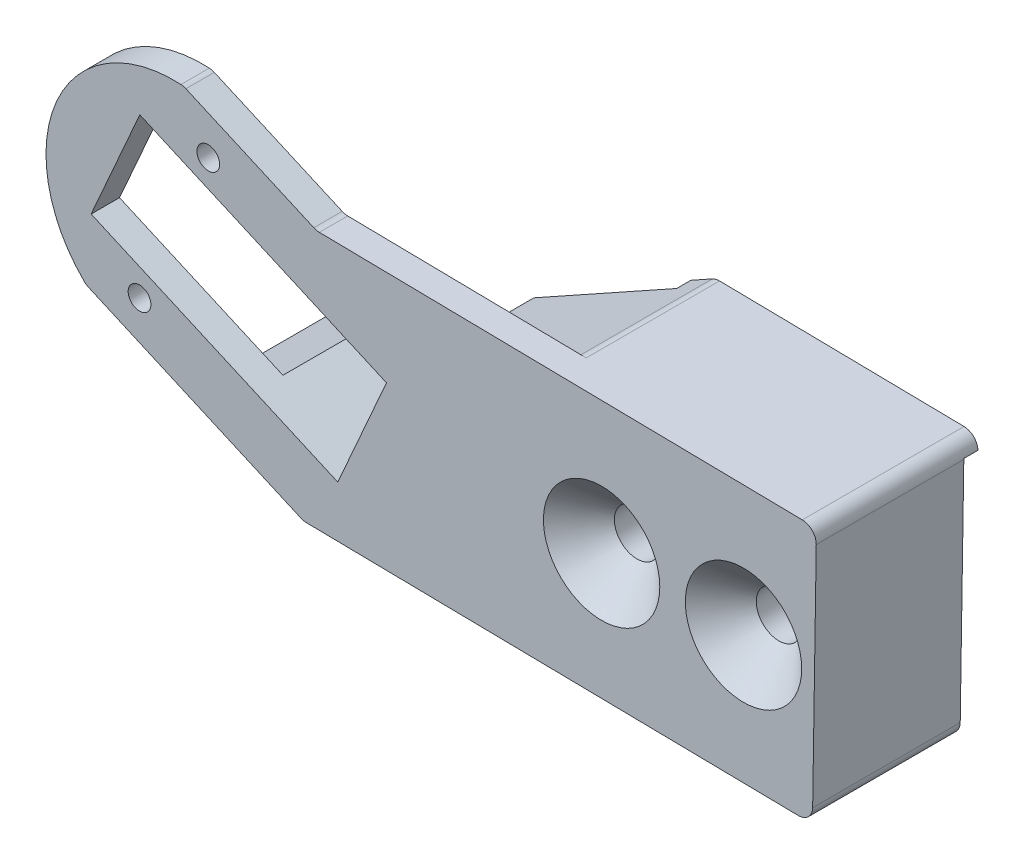
ISO-10303-21;
HEADER;
FILE_DESCRIPTION(('STEP AP214'),'2;1');
FILE_NAME('part.step','',(''),(''),'','','');
FILE_SCHEMA(('AUTOMOTIVE_DESIGN { 1 0 10303 214 1 1 1 1 }'));
ENDSEC;
DATA;
#1=APPLICATION_CONTEXT('core data for automotive mechanical design processes');
#2=APPLICATION_PROTOCOL_DEFINITION('international standard','automotive_design',2000,#1);
#3=PRODUCT_CONTEXT('',#1,'mechanical');
#4=PRODUCT('Part','Part','',(#3));
#5=PRODUCT_RELATED_PRODUCT_CATEGORY('part','',(#4));
#6=PRODUCT_DEFINITION_FORMATION('','',#4);
#7=PRODUCT_DEFINITION_CONTEXT('part definition',#1,'design');
#8=PRODUCT_DEFINITION('design','',#6,#7);
#9=PRODUCT_DEFINITION_SHAPE('','',#8);
#10=(LENGTH_UNIT() NAMED_UNIT(*) SI_UNIT(.MILLI.,.METRE.));
#11=(NAMED_UNIT(*) PLANE_ANGLE_UNIT() SI_UNIT($,.RADIAN.));
#12=(NAMED_UNIT(*) SI_UNIT($,.STERADIAN.) SOLID_ANGLE_UNIT());
#13=UNCERTAINTY_MEASURE_WITH_UNIT(LENGTH_MEASURE(1.E-05),#10,'distance_accuracy_value','');
#14=(GEOMETRIC_REPRESENTATION_CONTEXT(3) GLOBAL_UNCERTAINTY_ASSIGNED_CONTEXT((#13)) GLOBAL_UNIT_ASSIGNED_CONTEXT((#10,
#11,#12)) REPRESENTATION_CONTEXT('',''));
#15=CARTESIAN_POINT('',(0.,0.,0.));
#16=DIRECTION('',(0.,0.,1.));
#17=DIRECTION('',(1.,0.,0.));
#18=AXIS2_PLACEMENT_3D('',#15,#16,#17);
#19=CARTESIAN_POINT('',(-51.4220896142346,92.3739582166215,8.4));
#20=DIRECTION('',(0.486388848152945,-0.873742461136262,0.));
#21=DIRECTION('',(0.873742461136262,0.486388848152945,0.));
#22=AXIS2_PLACEMENT_3D('',#19,#20,#21);
#23=PLANE('',#22);
#24=DIRECTION('',(-0.873742461136262,-0.486388848152945,0.));
#25=VECTOR('',#24,1.);
#26=CARTESIAN_POINT('',(-51.4220896142346,92.3739582166215,0.));
#27=LINE('',#26,#25);
#28=CARTESIAN_POINT('',(116.600586745282,185.907647665343,0.));
#29=VERTEX_POINT('',#28);
#30=CARTESIAN_POINT('',(106.543150261814,180.308944198186,0.));
#31=VERTEX_POINT('',#30);
#32=EDGE_CURVE('E321',#29,#31,#27,.T.);
#33=ORIENTED_EDGE('',*,*,#32,.T.);
#34=DIRECTION('',(0.,0.,1.));
#35=VECTOR('',#34,1.);
#36=CARTESIAN_POINT('',(106.543150261814,180.308944198186,8.4));
#37=LINE('',#36,#35);
#38=CARTESIAN_POINT('',(106.543150261814,180.308944198186,8.4));
#39=VERTEX_POINT('',#38);
#40=EDGE_CURVE('E236',#31,#39,#37,.T.);
#41=ORIENTED_EDGE('',*,*,#40,.T.);
#42=DIRECTION('',(-0.873742461136262,-0.486388848152945,0.));
#43=VECTOR('',#42,1.);
#44=CARTESIAN_POINT('',(-51.4220896142346,92.3739582166215,8.4));
#45=LINE('',#44,#43);
#46=CARTESIAN_POINT('',(118.122776920208,186.755009855901,8.4));
#47=VERTEX_POINT('',#46);
#48=EDGE_CURVE('E301',#47,#39,#45,.T.);
#49=ORIENTED_EDGE('',*,*,#48,.F.);
#50=DIRECTION('',(0.,0.,-1.));
#51=VECTOR('',#50,1.);
#52=CARTESIAN_POINT('',(118.122776920208,186.755009855901,8.4));
#53=LINE('',#52,#51);
#54=CARTESIAN_POINT('',(118.122776920208,186.755009855901,-1.));
#55=VERTEX_POINT('',#54);
#56=EDGE_CURVE('E338',#47,#55,#53,.T.);
#57=ORIENTED_EDGE('',*,*,#56,.T.);
#58=DIRECTION('',(0.873742461136263,0.486388848152943,0.));
#59=VECTOR('',#58,1.);
#60=CARTESIAN_POINT('',(118.356895507062,186.885337354971,-1.));
#61=LINE('',#60,#59);
#62=CARTESIAN_POINT('',(116.600586745282,185.907647665343,-1.));
#63=VERTEX_POINT('',#62);
#64=EDGE_CURVE('E246',#63,#55,#61,.T.);
#65=ORIENTED_EDGE('',*,*,#64,.F.);
#66=DIRECTION('',(0.,0.,1.));
#67=VECTOR('',#66,1.);
#68=CARTESIAN_POINT('',(116.600586745282,185.907647665343,-1.));
#69=LINE('',#68,#67);
#70=EDGE_CURVE('E254',#63,#29,#69,.T.);
#71=ORIENTED_EDGE('',*,*,#70,.T.);
#72=EDGE_LOOP('',(#33,#41,#49,#57,#65,#71));
#73=FACE_BOUND('',#72,.T.);
#74=ADVANCED_FACE('F42',(#73),#23,.F.);
#75=CARTESIAN_POINT('',(0.,0.,0.));
#76=DIRECTION('',(0.,0.,1.));
#77=DIRECTION('',(1.,0.,0.));
#78=AXIS2_PLACEMENT_3D('',#75,#76,#77);
#79=PLANE('',#78);
#80=CARTESIAN_POINT('',(121.712578754783,177.50219774915,0.));
#81=DIRECTION('',(0.,0.,1.));
#82=DIRECTION('',(1.,0.,0.));
#83=AXIS2_PLACEMENT_3D('',#80,#81,#82);
#84=CIRCLE('',#83,1.60000000000001);
#85=CARTESIAN_POINT('',(123.312578754783,177.50219774915,0.));
#86=VERTEX_POINT('',#85);
#87=EDGE_CURVE('E308',#86,#86,#84,.T.);
#88=ORIENTED_EDGE('',*,*,#87,.T.);
#89=EDGE_LOOP('',(#88));
#90=FACE_BOUND('',#89,.T.);
#91=CARTESIAN_POINT('',(131.712578754783,177.50219774915,0.));
#92=DIRECTION('',(0.,0.,1.));
#93=DIRECTION('',(1.,0.,0.));
#94=AXIS2_PLACEMENT_3D('',#91,#92,#93);
#95=CIRCLE('',#94,1.6);
#96=CARTESIAN_POINT('',(133.312578754783,177.50219774915,0.));
#97=VERTEX_POINT('',#96);
#98=EDGE_CURVE('E290',#97,#97,#95,.T.);
#99=ORIENTED_EDGE('',*,*,#98,.T.);
#100=EDGE_LOOP('',(#99));
#101=FACE_BOUND('',#100,.T.);
#102=DIRECTION('',(0.914914778492503,-0.403647058822451,0.));
#103=VECTOR('',#102,1.);
#104=CARTESIAN_POINT('',(80.5237453705855,182.516787993051,0.));
#105=LINE('',#104,#103);
#106=CARTESIAN_POINT('',(97.2517137813336,175.136652260411,0.));
#107=VERTEX_POINT('',#106);
#108=CARTESIAN_POINT('',(103.119146539001,172.548026487666,0.));
#109=VERTEX_POINT('',#108);
#110=EDGE_CURVE('E230',#107,#109,#105,.T.);
#111=ORIENTED_EDGE('',*,*,#110,.T.);
#112=DIRECTION('',(0.40364705882245,0.914914778492503,0.));
#113=VECTOR('',#112,1.);
#114=CARTESIAN_POINT('',(22.5954011684161,-9.96876150538565,0.));
#115=LINE('',#114,#113);
#116=EDGE_CURVE('E239',#109,#31,#115,.T.);
#117=ORIENTED_EDGE('',*,*,#116,.T.);
#118=ORIENTED_EDGE('',*,*,#32,.F.);
#119=DIRECTION('',(-0.999918738516214,0.0127481906223379,0.));
#120=VECTOR('',#119,1.);
#121=CARTESIAN_POINT('',(116.600586745282,185.907647665343,0.));
#122=LINE('',#121,#120);
#123=CARTESIAN_POINT('',(136.839243814859,185.649620439404,0.));
#124=VERTEX_POINT('',#123);
#125=EDGE_CURVE('E245',#124,#29,#122,.T.);
#126=ORIENTED_EDGE('',*,*,#125,.F.);
#127=CARTESIAN_POINT('',(135.839965369066,185.611639025877,0.));
#128=DIRECTION('',(0.,0.,1.));
#129=DIRECTION('',(1.,0.,0.));
#130=AXIS2_PLACEMENT_3D('',#127,#128,#129);
#131=CIRCLE('',#130,1.);
#132=CARTESIAN_POINT('',(136.839842960852,185.595992893927,0.));
#133=VERTEX_POINT('',#132);
#134=EDGE_CURVE('E388',#124,#133,#131,.F.);
#135=ORIENTED_EDGE('',*,*,#134,.T.);
#136=DIRECTION('',(-0.0156461319502183,-0.999877591785613,0.));
#137=VECTOR('',#136,1.);
#138=CARTESIAN_POINT('',(133.902840431554,-2.09531799403535,0.));
#139=LINE('',#138,#137);
#140=CARTESIAN_POINT('',(136.586538780713,169.408402604373,0.));
#141=VERTEX_POINT('',#140);
#142=EDGE_CURVE('E317',#133,#141,#139,.T.);
#143=ORIENTED_EDGE('',*,*,#142,.T.);
#144=CARTESIAN_POINT('',(135.586661188928,169.424048736323,0.));
#145=DIRECTION('',(0.,0.,1.));
#146=DIRECTION('',(1.,0.,0.));
#147=AXIS2_PLACEMENT_3D('',#144,#145,#146);
#148=CIRCLE('',#147,1.);
#149=CARTESIAN_POINT('',(135.571015056977,168.424171144538,0.));
#150=VERTEX_POINT('',#149);
#151=EDGE_CURVE('E386',#141,#150,#148,.F.);
#152=ORIENTED_EDGE('',*,*,#151,.T.);
#153=DIRECTION('',(0.999877591785613,-0.0156461319502235,0.));
#154=VECTOR('',#153,1.);
#155=CARTESIAN_POINT('',(2.66805221720963,170.503843006624,0.));
#156=LINE('',#155,#154);
#157=CARTESIAN_POINT('',(100.903179260181,168.966655082333,0.));
#158=VERTEX_POINT('',#157);
#159=EDGE_CURVE('E314',#158,#150,#156,.T.);
#160=ORIENTED_EDGE('',*,*,#159,.F.);
#161=CARTESIAN_POINT('',(100.918825392131,169.966532674119,0.));
#162=DIRECTION('',(0.,0.,1.));
#163=DIRECTION('',(1.,0.,0.));
#164=AXIS2_PLACEMENT_3D('',#161,#162,#163);
#165=CIRCLE('',#164,1.);
#166=CARTESIAN_POINT('',(100.515178333308,169.051617895626,0.));
#167=VERTEX_POINT('',#166);
#168=EDGE_CURVE('E384',#158,#167,#165,.F.);
#169=ORIENTED_EDGE('',*,*,#168,.T.);
#170=DIRECTION('',(-0.914914778492503,0.40364705882245,0.));
#171=VECTOR('',#170,1.);
#172=CARTESIAN_POINT('',(78.80824537059,178.628400184458,0.));
#173=LINE('',#172,#171);
#174=CARTESIAN_POINT('',(92.5965029309412,172.545222011631,0.));
#175=VERTEX_POINT('',#174);
#176=EDGE_CURVE('E311',#167,#175,#173,.T.);
#177=ORIENTED_EDGE('',*,*,#176,.T.);
#178=EDGE_CURVE('E320',#107,#175,#27,.T.);
#179=ORIENTED_EDGE('',*,*,#178,.F.);
#180=EDGE_LOOP('',(#111,#117,#118,#126,#135,#143,#152,#160,#169,#177,#179));
#181=FACE_BOUND('',#180,.T.);
#182=ADVANCED_FACE('F485',(#90,#101,#181),#79,.F.);
#183=CARTESIAN_POINT('',(78.80824537059,178.628400184458,8.4));
#184=DIRECTION('',(-0.40364705882245,-0.914914778492503,0.));
#185=DIRECTION('',(0.914914778492503,-0.40364705882245,0.));
#186=AXIS2_PLACEMENT_3D('',#183,#184,#185);
#187=PLANE('',#186);
#188=DIRECTION('',(0.914914778492504,-0.403647058822448,0.));
#189=VECTOR('',#188,1.);
#190=CARTESIAN_POINT('',(85.3926379153872,175.723462208465,10.4));
#191=LINE('',#190,#189);
#192=CARTESIAN_POINT('',(85.5541055698286,175.652225033876,10.4));
#193=VERTEX_POINT('',#192);
#194=CARTESIAN_POINT('',(100.515178333308,169.051617895626,10.4));
#195=VERTEX_POINT('',#194);
#196=EDGE_CURVE('E271',#193,#195,#191,.T.);
#197=ORIENTED_EDGE('',*,*,#196,.F.);
#198=DIRECTION('',(0.,0.,1.));
#199=VECTOR('',#198,1.);
#200=CARTESIAN_POINT('',(85.5541055698286,175.652225033876,8.4));
#201=LINE('',#200,#199);
#202=CARTESIAN_POINT('',(85.5541055698286,175.652225033876,8.4));
#203=VERTEX_POINT('',#202);
#204=EDGE_CURVE('E379',#193,#203,#201,.F.);
#205=ORIENTED_EDGE('',*,*,#204,.T.);
#206=DIRECTION('',(0.914914778492504,-0.403647058822448,0.));
#207=VECTOR('',#206,1.);
#208=CARTESIAN_POINT('',(85.3926379153872,175.723462208465,8.4));
#209=LINE('',#208,#207);
#210=CARTESIAN_POINT('',(92.5965029309413,172.545222011631,8.4));
#211=VERTEX_POINT('',#210);
#212=EDGE_CURVE('E268',#203,#211,#209,.T.);
#213=ORIENTED_EDGE('',*,*,#212,.T.);
#214=DIRECTION('',(0.,0.,-1.));
#215=VECTOR('',#214,1.);
#216=CARTESIAN_POINT('',(92.5965029309412,172.545222011631,8.4));
#217=LINE('',#216,#215);
#218=EDGE_CURVE('E304',#211,#175,#217,.T.);
#219=ORIENTED_EDGE('',*,*,#218,.T.);
#220=ORIENTED_EDGE('',*,*,#176,.F.);
#221=DIRECTION('',(0.,0.,-1.));
#222=VECTOR('',#221,1.);
#223=CARTESIAN_POINT('',(100.515178333308,169.051617895626,10.4));
#224=LINE('',#223,#222);
#225=EDGE_CURVE('E377',#167,#195,#224,.F.);
#226=ORIENTED_EDGE('',*,*,#225,.T.);
#227=EDGE_LOOP('',(#197,#205,#213,#219,#220,#226));
#228=FACE_BOUND('',#227,.T.);
#229=ADVANCED_FACE('F437',(#228),#187,.T.);
#230=CARTESIAN_POINT('',(2.66805221720963,170.503843006624,8.4));
#231=DIRECTION('',(0.0156461319502235,0.999877591785613,0.));
#232=DIRECTION('',(-0.999877591785613,0.0156461319502235,0.));
#233=AXIS2_PLACEMENT_3D('',#230,#231,#232);
#234=PLANE('',#233);
#235=ORIENTED_EDGE('',*,*,#159,.T.);
#236=DIRECTION('',(0.,0.,-1.));
#237=VECTOR('',#236,1.);
#238=CARTESIAN_POINT('',(135.571015056977,168.424171144538,10.4));
#239=LINE('',#238,#237);
#240=CARTESIAN_POINT('',(135.571015056977,168.424171144538,10.4));
#241=VERTEX_POINT('',#240);
#242=EDGE_CURVE('E398',#150,#241,#239,.F.);
#243=ORIENTED_EDGE('',*,*,#242,.T.);
#244=DIRECTION('',(0.999877591785613,-0.0156461319502251,0.));
#245=VECTOR('',#244,1.);
#246=CARTESIAN_POINT('',(136.570892648763,168.408525012588,10.4));
#247=LINE('',#246,#245);
#248=CARTESIAN_POINT('',(100.903179260181,168.966655082333,10.4));
#249=VERTEX_POINT('',#248);
#250=EDGE_CURVE('E274',#249,#241,#247,.T.);
#251=ORIENTED_EDGE('',*,*,#250,.F.);
#252=DIRECTION('',(0.,0.,-1.));
#253=VECTOR('',#252,1.);
#254=CARTESIAN_POINT('',(100.903179260181,168.966655082333,0.));
#255=LINE('',#254,#253);
#256=EDGE_CURVE('E395',#249,#158,#255,.T.);
#257=ORIENTED_EDGE('',*,*,#256,.T.);
#258=EDGE_LOOP('',(#235,#243,#251,#257));
#259=FACE_BOUND('',#258,.T.);
#260=ADVANCED_FACE('F447',(#259),#234,.F.);
#261=CARTESIAN_POINT('',(133.902840431554,-2.09531799403535,8.4));
#262=DIRECTION('',(0.999877591785613,-0.0156461319502183,0.));
#263=DIRECTION('',(0.0156461319502183,0.999877591785613,0.));
#264=AXIS2_PLACEMENT_3D('',#261,#262,#263);
#265=PLANE('',#264);
#266=ORIENTED_EDGE('',*,*,#142,.F.);
#267=DIRECTION('',(0.,0.,-1.));
#268=VECTOR('',#267,1.);
#269=CARTESIAN_POINT('',(136.839842960852,185.595992893926,10.4));
#270=LINE('',#269,#268);
#271=CARTESIAN_POINT('',(136.839842960852,185.595992893926,10.4));
#272=VERTEX_POINT('',#271);
#273=EDGE_CURVE('E393',#133,#272,#270,.F.);
#274=ORIENTED_EDGE('',*,*,#273,.T.);
#275=DIRECTION('',(0.0156461319502183,0.999877591785613,0.));
#276=VECTOR('',#275,1.);
#277=CARTESIAN_POINT('',(136.855489092802,186.595870485712,10.4));
#278=LINE('',#277,#276);
#279=CARTESIAN_POINT('',(136.586538780713,169.408402604373,10.4));
#280=VERTEX_POINT('',#279);
#281=EDGE_CURVE('E278',#280,#272,#278,.T.);
#282=ORIENTED_EDGE('',*,*,#281,.F.);
#283=DIRECTION('',(0.,0.,-1.));
#284=VECTOR('',#283,1.);
#285=CARTESIAN_POINT('',(136.586538780713,169.408402604373,0.));
#286=LINE('',#285,#284);
#287=EDGE_CURVE('E390',#280,#141,#286,.T.);
#288=ORIENTED_EDGE('',*,*,#287,.T.);
#289=EDGE_LOOP('',(#266,#274,#282,#288));
#290=FACE_BOUND('',#289,.T.);
#291=ADVANCED_FACE('F457',(#290),#265,.T.);
#292=CARTESIAN_POINT('',(2.95264866124887,188.691188479748,8.4));
#293=DIRECTION('',(-0.015646131950223,-0.999877591785613,0.));
#294=DIRECTION('',(0.999877591785613,-0.015646131950223,0.));
#295=AXIS2_PLACEMENT_3D('',#292,#293,#294);
#296=PLANE('',#295);
#297=DIRECTION('',(0.999877591785613,-0.015646131950223,0.));
#298=VECTOR('',#297,1.);
#299=CARTESIAN_POINT('',(136.855489092802,186.595870485712,-1.));
#300=LINE('',#299,#298);
#301=CARTESIAN_POINT('',(118.624811900311,186.88114498655,-1.));
#302=VERTEX_POINT('',#301);
#303=CARTESIAN_POINT('',(135.855611501017,186.611516617662,-1.));
#304=VERTEX_POINT('',#303);
#305=EDGE_CURVE('E249',#302,#304,#300,.T.);
#306=ORIENTED_EDGE('',*,*,#305,.F.);
#307=DIRECTION('',(0.,0.,-1.));
#308=VECTOR('',#307,1.);
#309=CARTESIAN_POINT('',(118.624811900311,186.88114498655,8.4));
#310=LINE('',#309,#308);
#311=CARTESIAN_POINT('',(118.624811900311,186.88114498655,8.4));
#312=VERTEX_POINT('',#311);
#313=EDGE_CURVE('E350',#302,#312,#310,.F.);
#314=ORIENTED_EDGE('',*,*,#313,.T.);
#315=DIRECTION('',(-0.999877591785613,0.0156461319502248,0.));
#316=VECTOR('',#315,1.);
#317=CARTESIAN_POINT('',(101.615100710591,187.147313753503,8.4));
#318=LINE('',#317,#316);
#319=CARTESIAN_POINT('',(101.817709326749,187.144143324274,8.4));
#320=VERTEX_POINT('',#319);
#321=EDGE_CURVE('E293',#312,#320,#318,.T.);
#322=ORIENTED_EDGE('',*,*,#321,.T.);
#323=DIRECTION('',(0.,0.,-1.));
#324=VECTOR('',#323,1.);
#325=CARTESIAN_POINT('',(101.817709326749,187.144143324274,10.4));
#326=LINE('',#325,#324);
#327=CARTESIAN_POINT('',(101.817709326749,187.144143324274,10.4));
#328=VERTEX_POINT('',#327);
#329=EDGE_CURVE('E345',#320,#328,#326,.F.);
#330=ORIENTED_EDGE('',*,*,#329,.T.);
#331=DIRECTION('',(-0.999877591785613,0.0156461319502248,0.));
#332=VECTOR('',#331,1.);
#333=CARTESIAN_POINT('',(101.615100710591,187.147313753503,10.4));
#334=LINE('',#333,#332);
#335=CARTESIAN_POINT('',(135.855611501017,186.611516617662,10.4));
#336=VERTEX_POINT('',#335);
#337=EDGE_CURVE('E281',#336,#328,#334,.T.);
#338=ORIENTED_EDGE('',*,*,#337,.F.);
#339=DIRECTION('',(0.,0.,-1.));
#340=VECTOR('',#339,1.);
#341=CARTESIAN_POINT('',(135.855611501017,186.611516617662,-1.));
#342=LINE('',#341,#340);
#343=EDGE_CURVE('E347',#336,#304,#342,.T.);
#344=ORIENTED_EDGE('',*,*,#343,.T.);
#345=EDGE_LOOP('',(#306,#314,#322,#330,#338,#344));
#346=FACE_BOUND('',#345,.T.);
#347=ADVANCED_FACE('F410',(#346),#296,.F.);
#348=CARTESIAN_POINT('',(121.712578754783,177.50219774915,8.4));
#349=DIRECTION('',(0.,0.,-1.));
#350=DIRECTION('',(-1.,0.,0.));
#351=AXIS2_PLACEMENT_3D('',#348,#349,#350);
#352=CYLINDRICAL_SURFACE('',#351,1.60000000000001);
#353=CARTESIAN_POINT('',(121.712578754783,177.50219774915,7.90000000000001));
#354=DIRECTION('',(0.,0.,1.));
#355=DIRECTION('',(1.,0.,0.));
#356=AXIS2_PLACEMENT_3D('',#353,#354,#355);
#357=CIRCLE('',#356,1.60000000000001);
#358=CARTESIAN_POINT('',(123.312578754783,177.50219774915,7.90000000000001));
#359=VERTEX_POINT('',#358);
#360=EDGE_CURVE('E335',#359,#359,#357,.T.);
#361=ORIENTED_EDGE('',*,*,#360,.T.);
#362=EDGE_LOOP('',(#361));
#363=FACE_BOUND('',#362,.T.);
#364=ORIENTED_EDGE('',*,*,#87,.F.);
#365=EDGE_LOOP('',(#364));
#366=FACE_BOUND('',#365,.T.);
#367=ADVANCED_FACE('F502',(#363,#366),#352,.F.);
#368=CARTESIAN_POINT('',(131.712578754783,177.50219774915,8.4));
#369=DIRECTION('',(0.,0.,-1.));
#370=DIRECTION('',(-1.,0.,0.));
#371=AXIS2_PLACEMENT_3D('',#368,#369,#370);
#372=CYLINDRICAL_SURFACE('',#371,1.6);
#373=CARTESIAN_POINT('',(131.712578754783,177.50219774915,7.90000000000001));
#374=DIRECTION('',(0.,0.,1.));
#375=DIRECTION('',(1.,0.,0.));
#376=AXIS2_PLACEMENT_3D('',#373,#374,#375);
#377=CIRCLE('',#376,1.6);
#378=CARTESIAN_POINT('',(133.312578754783,177.50219774915,7.90000000000001));
#379=VERTEX_POINT('',#378);
#380=EDGE_CURVE('E326',#379,#379,#377,.T.);
#381=ORIENTED_EDGE('',*,*,#380,.T.);
#382=EDGE_LOOP('',(#381));
#383=FACE_BOUND('',#382,.T.);
#384=ORIENTED_EDGE('',*,*,#98,.F.);
#385=EDGE_LOOP('',(#384));
#386=FACE_BOUND('',#385,.T.);
#387=ADVANCED_FACE('F495',(#383,#386),#372,.F.);
#388=CARTESIAN_POINT('',(97.2517137813336,175.136652260411,8.4));
#389=VERTEX_POINT('',#388);
#390=EDGE_CURVE('E305',#389,#211,#45,.T.);
#391=ORIENTED_EDGE('',*,*,#390,.F.);
#392=DIRECTION('',(0.,0.,-1.));
#393=VECTOR('',#392,1.);
#394=CARTESIAN_POINT('',(97.2517137813336,175.136652260411,8.4));
#395=LINE('',#394,#393);
#396=EDGE_CURVE('E227',#389,#107,#395,.T.);
#397=ORIENTED_EDGE('',*,*,#396,.T.);
#398=ORIENTED_EDGE('',*,*,#178,.T.);
#399=ORIENTED_EDGE('',*,*,#218,.F.);
#400=EDGE_LOOP('',(#391,#397,#398,#399));
#401=FACE_BOUND('',#400,.T.);
#402=ADVANCED_FACE('F487',(#401),#23,.F.);
#403=CARTESIAN_POINT('',(91.5683822508555,182.289296649184,8.4));
#404=DIRECTION('',(0.,0.,1.));
#405=DIRECTION('',(1.,0.,0.));
#406=AXIS2_PLACEMENT_3D('',#403,#404,#405);
#407=PLANE('',#406);
#408=ORIENTED_EDGE('',*,*,#48,.T.);
#409=DIRECTION('',(0.40364705882245,0.914914778492503,0.));
#410=VECTOR('',#409,1.);
#411=CARTESIAN_POINT('',(104.834646538997,176.436414296259,8.4));
#412=LINE('',#411,#410);
#413=CARTESIAN_POINT('',(106.550146538992,180.324802104852,8.4));
#414=VERTEX_POINT('',#413);
#415=EDGE_CURVE('E233',#39,#414,#412,.T.);
#416=ORIENTED_EDGE('',*,*,#415,.T.);
#417=DIRECTION('',(-0.914914778492502,0.403647058822451,0.));
#418=VECTOR('',#417,1.);
#419=CARTESIAN_POINT('',(93.2838822508509,186.177684457777,8.4));
#420=LINE('',#419,#418);
#421=CARTESIAN_POINT('',(89.1667657476347,187.994096222478,8.4));
#422=VERTEX_POINT('',#421);
#423=EDGE_CURVE('E242',#414,#422,#420,.T.);
#424=ORIENTED_EDGE('',*,*,#423,.T.);
#425=DIRECTION('',(-0.403647058822451,-0.914914778492502,0.));
#426=VECTOR('',#425,1.);
#427=CARTESIAN_POINT('',(87.4512657476392,184.105708413885,8.4));
#428=LINE('',#427,#426);
#429=CARTESIAN_POINT('',(85.7357657476438,180.217320605292,8.4));
#430=VERTEX_POINT('',#429);
#431=EDGE_CURVE('E222',#422,#430,#428,.T.);
#432=ORIENTED_EDGE('',*,*,#431,.T.);
#433=DIRECTION('',(0.914914778492503,-0.403647058822451,0.));
#434=VECTOR('',#433,1.);
#435=CARTESIAN_POINT('',(89.8528822508601,178.400908840591,8.4));
#436=LINE('',#435,#434);
#437=EDGE_CURVE('E202',#430,#389,#436,.T.);
#438=ORIENTED_EDGE('',*,*,#437,.T.);
#439=ORIENTED_EDGE('',*,*,#390,.T.);
#440=ORIENTED_EDGE('',*,*,#212,.F.);
#441=CARTESIAN_POINT('',(85.9577526286511,176.567139812368,8.4));
#442=DIRECTION('',(0.,0.,1.));
#443=DIRECTION('',(1.,0.,0.));
#444=AXIS2_PLACEMENT_3D('',#441,#442,#443);
#445=CIRCLE('',#444,1.);
#446=CARTESIAN_POINT('',(85.2576384654306,175.853108889748,8.4));
#447=VERTEX_POINT('',#446);
#448=EDGE_CURVE('E358',#203,#447,#445,.F.);
#449=ORIENTED_EDGE('',*,*,#448,.T.);
#450=CARTESIAN_POINT('',(91.5683822508555,182.289296649184,8.4));
#451=DIRECTION('',(0.,0.,1.));
#452=DIRECTION('',(1.,0.,0.));
#453=AXIS2_PLACEMENT_3D('',#450,#451,#452);
#454=CIRCLE('',#453,9.01387818865997);
#455=CARTESIAN_POINT('',(92.0678719137971,191.289324986729,8.4));
#456=VERTEX_POINT('',#455);
#457=EDGE_CURVE('E275',#456,#447,#454,.T.);
#458=ORIENTED_EDGE('',*,*,#457,.F.);
#459=CARTESIAN_POINT('',(92.0124585109879,190.290861489756,8.4));
#460=DIRECTION('',(0.,0.,1.));
#461=DIRECTION('',(1.,0.,0.));
#462=AXIS2_PLACEMENT_3D('',#459,#460,#461);
#463=CIRCLE('',#462,1.);
#464=CARTESIAN_POINT('',(92.4161055698104,191.205776268248,8.4));
#465=VERTEX_POINT('',#464);
#466=EDGE_CURVE('E360',#456,#465,#463,.F.);
#467=ORIENTED_EDGE('',*,*,#466,.T.);
#468=DIRECTION('',(-0.914914778492503,0.40364705882245,0.));
#469=VECTOR('',#468,1.);
#470=CARTESIAN_POINT('',(101.615100710591,187.147313753503,8.4));
#471=LINE('',#470,#469);
#472=CARTESIAN_POINT('',(101.429708399877,187.229106137567,8.4));
#473=VERTEX_POINT('',#472);
#474=EDGE_CURVE('E296',#473,#465,#471,.T.);
#475=ORIENTED_EDGE('',*,*,#474,.F.);
#476=CARTESIAN_POINT('',(101.833355458699,188.144020916059,8.4));
#477=DIRECTION('',(0.,0.,1.));
#478=DIRECTION('',(1.,0.,0.));
#479=AXIS2_PLACEMENT_3D('',#476,#477,#478);
#480=CIRCLE('',#479,1.);
#481=EDGE_CURVE('E50',#473,#320,#480,.T.);
#482=ORIENTED_EDGE('',*,*,#481,.T.);
#483=ORIENTED_EDGE('',*,*,#321,.F.);
#484=CARTESIAN_POINT('',(118.609165768361,185.881267394764,8.4));
#485=DIRECTION('',(0.,0.,1.));
#486=DIRECTION('',(1.,0.,0.));
#487=AXIS2_PLACEMENT_3D('',#484,#485,#486);
#488=CIRCLE('',#487,1.);
#489=EDGE_CURVE('E400',#312,#47,#488,.T.);
#490=ORIENTED_EDGE('',*,*,#489,.T.);
#491=EDGE_LOOP('',(#408,#416,#424,#432,#438,#439,#440,#449,#458,#467,#475,#482,#483,#490));
#492=FACE_BOUND('',#491,.T.);
#493=CARTESIAN_POINT('',(89.1464998979208,176.799807978229,8.4));
#494=DIRECTION('',(0.,0.,1.));
#495=DIRECTION('',(1.,0.,0.));
#496=AXIS2_PLACEMENT_3D('',#493,#494,#495);
#497=CIRCLE('',#496,0.799999999999994);
#498=CARTESIAN_POINT('',(89.9464998979208,176.799807978229,8.4));
#499=VERTEX_POINT('',#498);
#500=EDGE_CURVE('E258',#499,#499,#497,.T.);
#501=ORIENTED_EDGE('',*,*,#500,.T.);
#502=EDGE_LOOP('',(#501));
#503=FACE_BOUND('',#502,.T.);
#504=CARTESIAN_POINT('',(93.9902646037902,187.778785320139,8.4));
#505=DIRECTION('',(0.,0.,1.));
#506=DIRECTION('',(1.,0.,0.));
#507=AXIS2_PLACEMENT_3D('',#504,#505,#506);
#508=CIRCLE('',#507,0.799999999999994);
#509=CARTESIAN_POINT('',(94.7902646037902,187.778785320139,8.4));
#510=VERTEX_POINT('',#509);
#511=EDGE_CURVE('E262',#510,#510,#508,.T.);
#512=ORIENTED_EDGE('',*,*,#511,.T.);
#513=EDGE_LOOP('',(#512));
#514=FACE_BOUND('',#513,.T.);
#515=ADVANCED_FACE('F403',(#492,#503,#514),#407,.F.);
#516=CARTESIAN_POINT('',(91.5683822508555,182.289296649184,10.4));
#517=DIRECTION('',(0.,0.,1.));
#518=DIRECTION('',(1.,0.,0.));
#519=AXIS2_PLACEMENT_3D('',#516,#517,#518);
#520=PLANE('',#519);
#521=DIRECTION('',(-0.914914778492502,0.403647058822451,0.));
#522=VECTOR('',#521,1.);
#523=CARTESIAN_POINT('',(97.4009987540672,184.361272693076,10.4));
#524=LINE('',#523,#522);
#525=CARTESIAN_POINT('',(106.550146538992,180.324802104852,10.4));
#526=VERTEX_POINT('',#525);
#527=CARTESIAN_POINT('',(89.1667657476347,187.994096222478,10.4));
#528=VERTEX_POINT('',#527);
#529=EDGE_CURVE('E65',#526,#528,#524,.T.);
#530=ORIENTED_EDGE('',*,*,#529,.F.);
#531=DIRECTION('',(0.40364705882245,0.914914778492503,0.));
#532=VECTOR('',#531,1.);
#533=CARTESIAN_POINT('',(106.550146538992,180.324802104852,10.4));
#534=LINE('',#533,#532);
#535=CARTESIAN_POINT('',(103.119146539001,172.548026487666,10.4));
#536=VERTEX_POINT('',#535);
#537=EDGE_CURVE('E215',#536,#526,#534,.T.);
#538=ORIENTED_EDGE('',*,*,#537,.F.);
#539=DIRECTION('',(0.914914778492503,-0.403647058822451,0.));
#540=VECTOR('',#539,1.);
#541=CARTESIAN_POINT('',(103.119146539001,172.548026487666,10.4));
#542=LINE('',#541,#540);
#543=CARTESIAN_POINT('',(85.7357657476438,180.217320605292,10.4));
#544=VERTEX_POINT('',#543);
#545=EDGE_CURVE('E199',#544,#536,#542,.T.);
#546=ORIENTED_EDGE('',*,*,#545,.F.);
#547=DIRECTION('',(-0.403647058822451,-0.914914778492502,0.));
#548=VECTOR('',#547,1.);
#549=CARTESIAN_POINT('',(85.7357657476438,180.217320605292,10.4));
#550=LINE('',#549,#548);
#551=EDGE_CURVE('E208',#528,#544,#550,.T.);
#552=ORIENTED_EDGE('',*,*,#551,.F.);
#553=EDGE_LOOP('',(#530,#538,#546,#552));
#554=FACE_BOUND('',#553,.T.);
#555=CARTESIAN_POINT('',(131.712578754783,177.50219774915,10.4));
#556=DIRECTION('',(0.,0.,1.));
#557=DIRECTION('',(1.,0.,0.));
#558=AXIS2_PLACEMENT_3D('',#555,#556,#557);
#559=CIRCLE('',#558,4.09999999999999);
#560=CARTESIAN_POINT('',(135.812578754783,177.50219774915,10.4));
#561=VERTEX_POINT('',#560);
#562=EDGE_CURVE('E332',#561,#561,#559,.F.);
#563=ORIENTED_EDGE('',*,*,#562,.T.);
#564=EDGE_LOOP('',(#563));
#565=FACE_BOUND('',#564,.T.);
#566=CARTESIAN_POINT('',(121.712578754783,177.50219774915,10.4));
#567=DIRECTION('',(0.,0.,1.));
#568=DIRECTION('',(1.,0.,0.));
#569=AXIS2_PLACEMENT_3D('',#566,#567,#568);
#570=CIRCLE('',#569,4.10000000000001);
#571=CARTESIAN_POINT('',(125.812578754783,177.50219774915,10.4));
#572=VERTEX_POINT('',#571);
#573=EDGE_CURVE('E329',#572,#572,#570,.F.);
#574=ORIENTED_EDGE('',*,*,#573,.T.);
#575=EDGE_LOOP('',(#574));
#576=FACE_BOUND('',#575,.T.);
#577=CARTESIAN_POINT('',(93.9902646037902,187.778785320139,10.4));
#578=DIRECTION('',(0.,0.,1.));
#579=DIRECTION('',(1.,0.,0.));
#580=AXIS2_PLACEMENT_3D('',#577,#578,#579);
#581=CIRCLE('',#580,0.799999999999994);
#582=CARTESIAN_POINT('',(94.7902646037902,187.778785320139,10.4));
#583=VERTEX_POINT('',#582);
#584=EDGE_CURVE('E265',#583,#583,#581,.T.);
#585=ORIENTED_EDGE('',*,*,#584,.F.);
#586=EDGE_LOOP('',(#585));
#587=FACE_BOUND('',#586,.T.);
#588=DIRECTION('',(-0.914914778492503,0.40364705882245,0.));
#589=VECTOR('',#588,1.);
#590=CARTESIAN_POINT('',(101.615100710591,187.147313753503,10.4));
#591=LINE('',#590,#589);
#592=CARTESIAN_POINT('',(101.429708399877,187.229106137567,10.4));
#593=VERTEX_POINT('',#592);
#594=CARTESIAN_POINT('',(92.4161055698104,191.205776268248,10.4));
#595=VERTEX_POINT('',#594);
#596=EDGE_CURVE('E284',#593,#595,#591,.T.);
#597=ORIENTED_EDGE('',*,*,#596,.T.);
#598=CARTESIAN_POINT('',(92.0124585109879,190.290861489756,10.4));
#599=DIRECTION('',(0.,0.,1.));
#600=DIRECTION('',(1.,0.,0.));
#601=AXIS2_PLACEMENT_3D('',#598,#599,#600);
#602=CIRCLE('',#601,1.);
#603=CARTESIAN_POINT('',(92.0678719137971,191.289324986729,10.4));
#604=VERTEX_POINT('',#603);
#605=EDGE_CURVE('E375',#595,#604,#602,.T.);
#606=ORIENTED_EDGE('',*,*,#605,.T.);
#607=CARTESIAN_POINT('',(91.5683822508555,182.289296649184,10.4));
#608=DIRECTION('',(0.,0.,1.));
#609=DIRECTION('',(1.,0.,0.));
#610=AXIS2_PLACEMENT_3D('',#607,#608,#609);
#611=CIRCLE('',#610,9.01387818865997);
#612=CARTESIAN_POINT('',(85.2576384654306,175.853108889748,10.4));
#613=VERTEX_POINT('',#612);
#614=EDGE_CURVE('E287',#604,#613,#611,.T.);
#615=ORIENTED_EDGE('',*,*,#614,.T.);
#616=CARTESIAN_POINT('',(85.9577526286511,176.567139812368,10.4));
#617=DIRECTION('',(0.,0.,1.));
#618=DIRECTION('',(1.,0.,0.));
#619=AXIS2_PLACEMENT_3D('',#616,#617,#618);
#620=CIRCLE('',#619,1.);
#621=EDGE_CURVE('E373',#613,#193,#620,.T.);
#622=ORIENTED_EDGE('',*,*,#621,.T.);
#623=ORIENTED_EDGE('',*,*,#196,.T.);
#624=CARTESIAN_POINT('',(100.918825392131,169.966532674119,10.4));
#625=DIRECTION('',(0.,0.,1.));
#626=DIRECTION('',(1.,0.,0.));
#627=AXIS2_PLACEMENT_3D('',#624,#625,#626);
#628=CIRCLE('',#627,1.);
#629=EDGE_CURVE('E367',#195,#249,#628,.T.);
#630=ORIENTED_EDGE('',*,*,#629,.T.);
#631=ORIENTED_EDGE('',*,*,#250,.T.);
#632=CARTESIAN_POINT('',(135.586661188928,169.424048736323,10.4));
#633=DIRECTION('',(0.,0.,1.));
#634=DIRECTION('',(1.,0.,0.));
#635=AXIS2_PLACEMENT_3D('',#632,#633,#634);
#636=CIRCLE('',#635,1.);
#637=EDGE_CURVE('E369',#241,#280,#636,.T.);
#638=ORIENTED_EDGE('',*,*,#637,.T.);
#639=ORIENTED_EDGE('',*,*,#281,.T.);
#640=CARTESIAN_POINT('',(135.839965369066,185.611639025877,10.4));
#641=DIRECTION('',(0.,0.,1.));
#642=DIRECTION('',(1.,0.,0.));
#643=AXIS2_PLACEMENT_3D('',#640,#641,#642);
#644=CIRCLE('',#643,1.);
#645=EDGE_CURVE('E371',#272,#336,#644,.T.);
#646=ORIENTED_EDGE('',*,*,#645,.T.);
#647=ORIENTED_EDGE('',*,*,#337,.T.);
#648=CARTESIAN_POINT('',(101.833355458699,188.144020916059,10.4));
#649=DIRECTION('',(0.,0.,1.));
#650=DIRECTION('',(1.,0.,0.));
#651=AXIS2_PLACEMENT_3D('',#648,#649,#650);
#652=CIRCLE('',#651,1.);
#653=EDGE_CURVE('E11',#328,#593,#652,.F.);
#654=ORIENTED_EDGE('',*,*,#653,.T.);
#655=EDGE_LOOP('',(#597,#606,#615,#622,#623,#630,#631,#638,#639,#646,#647,#654));
#656=FACE_BOUND('',#655,.T.);
#657=CARTESIAN_POINT('',(89.1464998979208,176.799807978229,10.4));
#658=DIRECTION('',(0.,0.,1.));
#659=DIRECTION('',(1.,0.,0.));
#660=AXIS2_PLACEMENT_3D('',#657,#658,#659);
#661=CIRCLE('',#660,0.799999999999994);
#662=CARTESIAN_POINT('',(89.9464998979208,176.799807978229,10.4));
#663=VERTEX_POINT('',#662);
#664=EDGE_CURVE('E259',#663,#663,#661,.T.);
#665=ORIENTED_EDGE('',*,*,#664,.F.);
#666=EDGE_LOOP('',(#665));
#667=FACE_BOUND('',#666,.T.);
#668=ADVANCED_FACE('F212',(#554,#565,#576,#587,#656,#667),#520,.T.);
#669=CARTESIAN_POINT('',(101.615100710591,187.147313753503,10.4));
#670=DIRECTION('',(-0.40364705882245,-0.914914778492503,0.));
#671=DIRECTION('',(0.914914778492503,-0.40364705882245,0.));
#672=AXIS2_PLACEMENT_3D('',#669,#670,#671);
#673=PLANE('',#672);
#674=ORIENTED_EDGE('',*,*,#474,.T.);
#675=DIRECTION('',(0.,0.,-1.));
#676=VECTOR('',#675,1.);
#677=CARTESIAN_POINT('',(92.4161055698104,191.205776268248,10.4));
#678=LINE('',#677,#676);
#679=EDGE_CURVE('E365',#465,#595,#678,.F.);
#680=ORIENTED_EDGE('',*,*,#679,.T.);
#681=ORIENTED_EDGE('',*,*,#596,.F.);
#682=DIRECTION('',(0.,0.,-1.));
#683=VECTOR('',#682,1.);
#684=CARTESIAN_POINT('',(101.429708399877,187.229106137567,8.4));
#685=LINE('',#684,#683);
#686=EDGE_CURVE('E362',#593,#473,#685,.T.);
#687=ORIENTED_EDGE('',*,*,#686,.T.);
#688=EDGE_LOOP('',(#674,#680,#681,#687));
#689=FACE_BOUND('',#688,.T.);
#690=ADVANCED_FACE('F420',(#689),#673,.F.);
#691=CARTESIAN_POINT('',(91.5683822508555,182.289296649184,10.4));
#692=DIRECTION('',(0.,0.,-1.));
#693=DIRECTION('',(-1.,0.,0.));
#694=AXIS2_PLACEMENT_3D('',#691,#692,#693);
#695=CYLINDRICAL_SURFACE('',#694,9.01387818865997);
#696=ORIENTED_EDGE('',*,*,#614,.F.);
#697=DIRECTION('',(0.,0.,-1.));
#698=VECTOR('',#697,1.);
#699=CARTESIAN_POINT('',(92.0678719137971,191.289324986729,10.4));
#700=LINE('',#699,#698);
#701=EDGE_CURVE('E355',#604,#456,#700,.T.);
#702=ORIENTED_EDGE('',*,*,#701,.T.);
#703=ORIENTED_EDGE('',*,*,#457,.T.);
#704=DIRECTION('',(0.,0.,-1.));
#705=VECTOR('',#704,1.);
#706=CARTESIAN_POINT('',(85.2576384654306,175.853108889748,10.4));
#707=LINE('',#706,#705);
#708=EDGE_CURVE('E353',#447,#613,#707,.F.);
#709=ORIENTED_EDGE('',*,*,#708,.T.);
#710=EDGE_LOOP('',(#696,#702,#703,#709));
#711=FACE_BOUND('',#710,.T.);
#712=ADVANCED_FACE('F428',(#711),#695,.T.);
#713=CARTESIAN_POINT('',(93.9902646037902,187.778785320139,10.4));
#714=DIRECTION('',(0.,0.,-1.));
#715=DIRECTION('',(-1.,0.,0.));
#716=AXIS2_PLACEMENT_3D('',#713,#714,#715);
#717=CYLINDRICAL_SURFACE('',#716,0.799999999999994);
#718=ORIENTED_EDGE('',*,*,#584,.T.);
#719=EDGE_LOOP('',(#718));
#720=FACE_BOUND('',#719,.T.);
#721=ORIENTED_EDGE('',*,*,#511,.F.);
#722=EDGE_LOOP('',(#721));
#723=FACE_BOUND('',#722,.T.);
#724=ADVANCED_FACE('F523',(#720,#723),#717,.F.);
#725=CARTESIAN_POINT('',(89.1464998979208,176.799807978229,10.4));
#726=DIRECTION('',(0.,0.,-1.));
#727=DIRECTION('',(-1.,0.,0.));
#728=AXIS2_PLACEMENT_3D('',#725,#726,#727);
#729=CYLINDRICAL_SURFACE('',#728,0.799999999999994);
#730=ORIENTED_EDGE('',*,*,#664,.T.);
#731=EDGE_LOOP('',(#730));
#732=FACE_BOUND('',#731,.T.);
#733=ORIENTED_EDGE('',*,*,#500,.F.);
#734=EDGE_LOOP('',(#733));
#735=FACE_BOUND('',#734,.T.);
#736=ADVANCED_FACE('F515',(#732,#735),#729,.F.);
#737=CARTESIAN_POINT('',(116.600586745282,185.907647665343,-1.));
#738=DIRECTION('',(0.0127481906223379,0.999918738516214,0.));
#739=DIRECTION('',(-0.999918738516214,0.0127481906223379,0.));
#740=AXIS2_PLACEMENT_3D('',#737,#738,#739);
#741=PLANE('',#740);
#742=DIRECTION('',(-0.999918738516214,0.0127481906223379,0.));
#743=VECTOR('',#742,1.);
#744=CARTESIAN_POINT('',(116.600586745282,185.907647665343,-1.));
#745=LINE('',#744,#743);
#746=CARTESIAN_POINT('',(136.839243814859,185.649620439404,-1.));
#747=VERTEX_POINT('',#746);
#748=EDGE_CURVE('E252',#747,#63,#745,.T.);
#749=ORIENTED_EDGE('',*,*,#748,.F.);
#750=DIRECTION('',(0.,0.,1.));
#751=VECTOR('',#750,1.);
#752=CARTESIAN_POINT('',(136.839243814859,185.649620439404,-1.));
#753=LINE('',#752,#751);
#754=EDGE_CURVE('E382',#747,#124,#753,.T.);
#755=ORIENTED_EDGE('',*,*,#754,.T.);
#756=ORIENTED_EDGE('',*,*,#125,.T.);
#757=ORIENTED_EDGE('',*,*,#70,.F.);
#758=EDGE_LOOP('',(#749,#755,#756,#757));
#759=FACE_BOUND('',#758,.T.);
#760=ADVANCED_FACE('F513',(#759),#741,.F.);
#761=CARTESIAN_POINT('',(0.,0.,-1.));
#762=DIRECTION('',(0.,0.,-1.));
#763=DIRECTION('',(-1.,0.,0.));
#764=AXIS2_PLACEMENT_3D('',#761,#762,#763);
#765=PLANE('',#764);
#766=ORIENTED_EDGE('',*,*,#64,.T.);
#767=CARTESIAN_POINT('',(118.609165768361,185.881267394764,-1.));
#768=DIRECTION('',(0.,0.,-1.));
#769=DIRECTION('',(-1.,0.,0.));
#770=AXIS2_PLACEMENT_3D('',#767,#768,#769);
#771=CIRCLE('',#770,1.);
#772=EDGE_CURVE('E343',#55,#302,#771,.T.);
#773=ORIENTED_EDGE('',*,*,#772,.T.);
#774=ORIENTED_EDGE('',*,*,#305,.T.);
#775=CARTESIAN_POINT('',(135.839965369066,185.611639025877,-1.));
#776=DIRECTION('',(0.,0.,-1.));
#777=DIRECTION('',(-1.,0.,0.));
#778=AXIS2_PLACEMENT_3D('',#775,#776,#777);
#779=CIRCLE('',#778,1.);
#780=EDGE_CURVE('E341',#304,#747,#779,.T.);
#781=ORIENTED_EDGE('',*,*,#780,.T.);
#782=ORIENTED_EDGE('',*,*,#748,.T.);
#783=EDGE_LOOP('',(#766,#773,#774,#781,#782));
#784=FACE_BOUND('',#783,.T.);
#785=ADVANCED_FACE('F465',(#784),#765,.T.);
#786=CARTESIAN_POINT('',(131.712578754783,177.50219774915,7.90000000000001));
#787=DIRECTION('',(0.,0.,1.));
#788=DIRECTION('',(1.,0.,0.));
#789=AXIS2_PLACEMENT_3D('',#786,#787,#788);
#790=CONICAL_SURFACE('',#789,1.6,0.78539816339745);
#791=ORIENTED_EDGE('',*,*,#562,.F.);
#792=EDGE_LOOP('',(#791));
#793=FACE_BOUND('',#792,.T.);
#794=ORIENTED_EDGE('',*,*,#380,.F.);
#795=EDGE_LOOP('',(#794));
#796=FACE_BOUND('',#795,.T.);
#797=ADVANCED_FACE('F521',(#793,#796),#790,.F.);
#798=CARTESIAN_POINT('',(121.712578754783,177.50219774915,7.90000000000001));
#799=DIRECTION('',(0.,0.,1.));
#800=DIRECTION('',(1.,0.,0.));
#801=AXIS2_PLACEMENT_3D('',#798,#799,#800);
#802=CONICAL_SURFACE('',#801,1.60000000000001,0.78539816339745);
#803=ORIENTED_EDGE('',*,*,#573,.F.);
#804=EDGE_LOOP('',(#803));
#805=FACE_BOUND('',#804,.T.);
#806=ORIENTED_EDGE('',*,*,#360,.F.);
#807=EDGE_LOOP('',(#806));
#808=FACE_BOUND('',#807,.T.);
#809=ADVANCED_FACE('F583',(#805,#808),#802,.F.);
#810=CARTESIAN_POINT('',(118.609165768361,185.881267394764,8.4));
#811=DIRECTION('',(0.,0.,-1.));
#812=DIRECTION('',(-1.,0.,0.));
#813=AXIS2_PLACEMENT_3D('',#810,#811,#812);
#814=CYLINDRICAL_SURFACE('',#813,1.);
#815=ORIENTED_EDGE('',*,*,#489,.F.);
#816=ORIENTED_EDGE('',*,*,#313,.F.);
#817=ORIENTED_EDGE('',*,*,#772,.F.);
#818=ORIENTED_EDGE('',*,*,#56,.F.);
#819=EDGE_LOOP('',(#815,#816,#817,#818));
#820=FACE_BOUND('',#819,.T.);
#821=ADVANCED_FACE('F470',(#820),#814,.T.);
#822=CARTESIAN_POINT('',(92.0124585109879,190.290861489756,10.4));
#823=DIRECTION('',(0.,0.,-1.));
#824=DIRECTION('',(-1.,0.,0.));
#825=AXIS2_PLACEMENT_3D('',#822,#823,#824);
#826=CYLINDRICAL_SURFACE('',#825,1.);
#827=ORIENTED_EDGE('',*,*,#605,.F.);
#828=ORIENTED_EDGE('',*,*,#679,.F.);
#829=ORIENTED_EDGE('',*,*,#466,.F.);
#830=ORIENTED_EDGE('',*,*,#701,.F.);
#831=EDGE_LOOP('',(#827,#828,#829,#830));
#832=FACE_BOUND('',#831,.T.);
#833=ADVANCED_FACE('F423',(#832),#826,.T.);
#834=CARTESIAN_POINT('',(85.9577526286511,176.567139812368,10.4));
#835=DIRECTION('',(0.,0.,-1.));
#836=DIRECTION('',(-1.,0.,0.));
#837=AXIS2_PLACEMENT_3D('',#834,#835,#836);
#838=CYLINDRICAL_SURFACE('',#837,1.);
#839=ORIENTED_EDGE('',*,*,#621,.F.);
#840=ORIENTED_EDGE('',*,*,#708,.F.);
#841=ORIENTED_EDGE('',*,*,#448,.F.);
#842=ORIENTED_EDGE('',*,*,#204,.F.);
#843=EDGE_LOOP('',(#839,#840,#841,#842));
#844=FACE_BOUND('',#843,.T.);
#845=ADVANCED_FACE('F432',(#844),#838,.T.);
#846=CARTESIAN_POINT('',(135.839965369066,185.611639025877,8.4));
#847=DIRECTION('',(0.,0.,1.));
#848=DIRECTION('',(1.,0.,0.));
#849=AXIS2_PLACEMENT_3D('',#846,#847,#848);
#850=CYLINDRICAL_SURFACE('',#849,1.);
#851=ORIENTED_EDGE('',*,*,#645,.F.);
#852=ORIENTED_EDGE('',*,*,#273,.F.);
#853=ORIENTED_EDGE('',*,*,#134,.F.);
#854=ORIENTED_EDGE('',*,*,#754,.F.);
#855=ORIENTED_EDGE('',*,*,#780,.F.);
#856=ORIENTED_EDGE('',*,*,#343,.F.);
#857=EDGE_LOOP('',(#851,#852,#853,#854,#855,#856));
#858=FACE_BOUND('',#857,.T.);
#859=ADVANCED_FACE('F461',(#858),#850,.T.);
#860=CARTESIAN_POINT('',(135.586661188928,169.424048736323,8.4));
#861=DIRECTION('',(0.,0.,1.));
#862=DIRECTION('',(1.,0.,0.));
#863=AXIS2_PLACEMENT_3D('',#860,#861,#862);
#864=CYLINDRICAL_SURFACE('',#863,1.);
#865=ORIENTED_EDGE('',*,*,#637,.F.);
#866=ORIENTED_EDGE('',*,*,#242,.F.);
#867=ORIENTED_EDGE('',*,*,#151,.F.);
#868=ORIENTED_EDGE('',*,*,#287,.F.);
#869=EDGE_LOOP('',(#865,#866,#867,#868));
#870=FACE_BOUND('',#869,.T.);
#871=ADVANCED_FACE('F451',(#870),#864,.T.);
#872=CARTESIAN_POINT('',(100.918825392131,169.966532674119,8.4));
#873=DIRECTION('',(0.,0.,1.));
#874=DIRECTION('',(1.,0.,0.));
#875=AXIS2_PLACEMENT_3D('',#872,#873,#874);
#876=CYLINDRICAL_SURFACE('',#875,1.);
#877=ORIENTED_EDGE('',*,*,#629,.F.);
#878=ORIENTED_EDGE('',*,*,#225,.F.);
#879=ORIENTED_EDGE('',*,*,#168,.F.);
#880=ORIENTED_EDGE('',*,*,#256,.F.);
#881=EDGE_LOOP('',(#877,#878,#879,#880));
#882=FACE_BOUND('',#881,.T.);
#883=ADVANCED_FACE('F442',(#882),#876,.T.);
#884=CARTESIAN_POINT('',(101.833355458699,188.144020916059,10.4));
#885=DIRECTION('',(0.,0.,1.));
#886=DIRECTION('',(1.,0.,0.));
#887=AXIS2_PLACEMENT_3D('',#884,#885,#886);
#888=CYLINDRICAL_SURFACE('',#887,1.);
#889=ORIENTED_EDGE('',*,*,#653,.F.);
#890=ORIENTED_EDGE('',*,*,#329,.F.);
#891=ORIENTED_EDGE('',*,*,#481,.F.);
#892=ORIENTED_EDGE('',*,*,#686,.F.);
#893=EDGE_LOOP('',(#889,#890,#891,#892));
#894=FACE_BOUND('',#893,.T.);
#895=ADVANCED_FACE('F44',(#894),#888,.F.);
#896=CARTESIAN_POINT('',(97.4009987540672,184.361272693076,-9.6));
#897=DIRECTION('',(0.403647058822451,0.914914778492502,0.));
#898=DIRECTION('',(-0.914914778492502,0.403647058822451,0.));
#899=AXIS2_PLACEMENT_3D('',#896,#897,#898);
#900=PLANE('',#899);
#901=DIRECTION('',(0.,0.,1.));
#902=VECTOR('',#901,1.);
#903=CARTESIAN_POINT('',(106.550146538992,180.324802104852,-9.6));
#904=LINE('',#903,#902);
#905=EDGE_CURVE('E220',#414,#526,#904,.T.);
#906=ORIENTED_EDGE('',*,*,#905,.T.);
#907=ORIENTED_EDGE('',*,*,#529,.T.);
#908=DIRECTION('',(0.,0.,1.));
#909=VECTOR('',#908,1.);
#910=CARTESIAN_POINT('',(89.1667657476347,187.994096222478,-9.6));
#911=LINE('',#910,#909);
#912=EDGE_CURVE('E205',#422,#528,#911,.T.);
#913=ORIENTED_EDGE('',*,*,#912,.F.);
#914=ORIENTED_EDGE('',*,*,#423,.F.);
#915=EDGE_LOOP('',(#906,#907,#913,#914));
#916=FACE_BOUND('',#915,.T.);
#917=ADVANCED_FACE('F476',(#916),#900,.F.);
#918=CARTESIAN_POINT('',(106.550146538992,180.324802104852,-9.6));
#919=DIRECTION('',(0.914914778492503,-0.40364705882245,0.));
#920=DIRECTION('',(0.40364705882245,0.914914778492503,0.));
#921=AXIS2_PLACEMENT_3D('',#918,#919,#920);
#922=PLANE('',#921);
#923=DIRECTION('',(0.,0.,1.));
#924=VECTOR('',#923,1.);
#925=CARTESIAN_POINT('',(103.119146539001,172.548026487666,-9.6));
#926=LINE('',#925,#924);
#927=EDGE_CURVE('E204',#109,#536,#926,.T.);
#928=ORIENTED_EDGE('',*,*,#927,.T.);
#929=ORIENTED_EDGE('',*,*,#537,.T.);
#930=ORIENTED_EDGE('',*,*,#905,.F.);
#931=ORIENTED_EDGE('',*,*,#415,.F.);
#932=ORIENTED_EDGE('',*,*,#40,.F.);
#933=ORIENTED_EDGE('',*,*,#116,.F.);
#934=EDGE_LOOP('',(#928,#929,#930,#931,#932,#933));
#935=FACE_BOUND('',#934,.T.);
#936=ADVANCED_FACE('F475',(#935),#922,.F.);
#937=CARTESIAN_POINT('',(103.119146539001,172.548026487666,-9.6));
#938=DIRECTION('',(-0.403647058822451,-0.914914778492503,0.));
#939=DIRECTION('',(0.914914778492503,-0.403647058822451,0.));
#940=AXIS2_PLACEMENT_3D('',#937,#938,#939);
#941=PLANE('',#940);
#942=ORIENTED_EDGE('',*,*,#396,.F.);
#943=ORIENTED_EDGE('',*,*,#437,.F.);
#944=DIRECTION('',(0.,0.,1.));
#945=VECTOR('',#944,1.);
#946=CARTESIAN_POINT('',(85.7357657476438,180.217320605292,-9.6));
#947=LINE('',#946,#945);
#948=EDGE_CURVE('E57',#430,#544,#947,.T.);
#949=ORIENTED_EDGE('',*,*,#948,.T.);
#950=ORIENTED_EDGE('',*,*,#545,.T.);
#951=ORIENTED_EDGE('',*,*,#927,.F.);
#952=ORIENTED_EDGE('',*,*,#110,.F.);
#953=EDGE_LOOP('',(#942,#943,#949,#950,#951,#952));
#954=FACE_BOUND('',#953,.T.);
#955=ADVANCED_FACE('F196',(#954),#941,.F.);
#956=CARTESIAN_POINT('',(85.7357657476438,180.217320605292,-9.6));
#957=DIRECTION('',(-0.914914778492502,0.403647058822451,0.));
#958=DIRECTION('',(-0.403647058822451,-0.914914778492502,0.));
#959=AXIS2_PLACEMENT_3D('',#956,#957,#958);
#960=PLANE('',#959);
#961=ORIENTED_EDGE('',*,*,#912,.T.);
#962=ORIENTED_EDGE('',*,*,#551,.T.);
#963=ORIENTED_EDGE('',*,*,#948,.F.);
#964=ORIENTED_EDGE('',*,*,#431,.F.);
#965=EDGE_LOOP('',(#961,#962,#963,#964));
#966=FACE_BOUND('',#965,.T.);
#967=ADVANCED_FACE('F209',(#966),#960,.F.);
#968=CLOSED_SHELL('',(#74,#182,#229,#260,#291,#347,#367,#387,#402,#515,#668,#690,#712,#724,#736,
#760,#785,#797,#809,#821,#833,#845,#859,#871,#883,#895,#917,#936,#955,#967));
#969=MANIFOLD_SOLID_BREP('B2',#968);
#970=ADVANCED_BREP_SHAPE_REPRESENTATION('',(#18,#969),#14);
#971=SHAPE_DEFINITION_REPRESENTATION(#9,#970);
ENDSEC;
END-ISO-10303-21;
